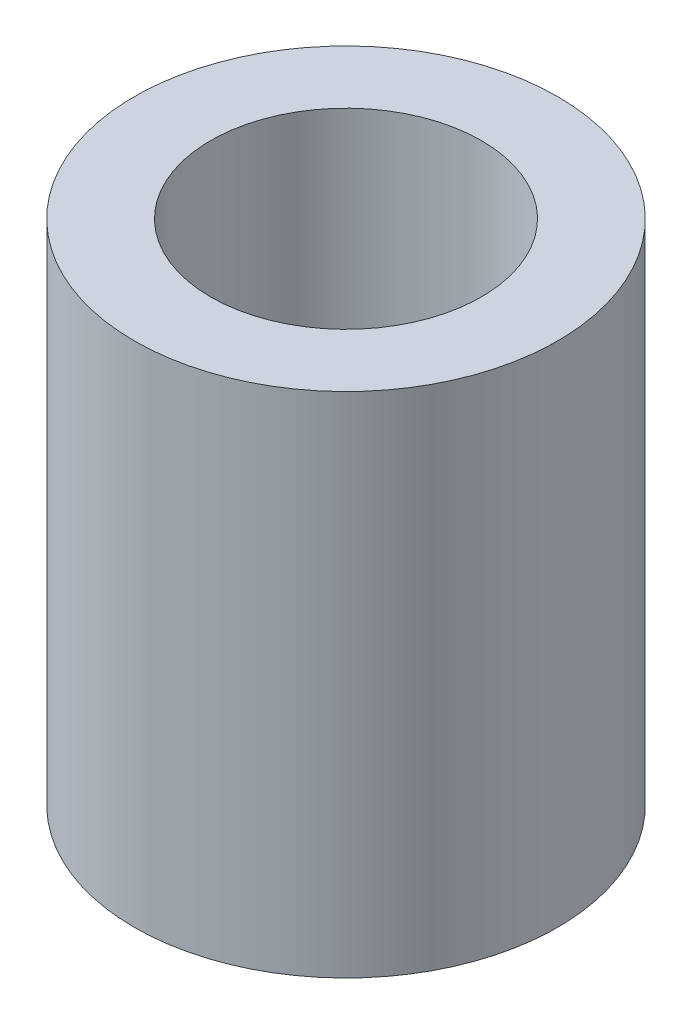
ISO-10303-21;
HEADER;
FILE_DESCRIPTION(('STEP AP214'),'2;1');
FILE_NAME('part.step','',(''),(''),'','','');
FILE_SCHEMA(('AUTOMOTIVE_DESIGN { 1 0 10303 214 1 1 1 1 }'));
ENDSEC;
DATA;
#1=APPLICATION_CONTEXT('core data for automotive mechanical design processes');
#2=APPLICATION_PROTOCOL_DEFINITION('international standard','automotive_design',2000,#1);
#3=PRODUCT_CONTEXT('',#1,'mechanical');
#4=PRODUCT('Part','Part','',(#3));
#5=PRODUCT_RELATED_PRODUCT_CATEGORY('part','',(#4));
#6=PRODUCT_DEFINITION_FORMATION('','',#4);
#7=PRODUCT_DEFINITION_CONTEXT('part definition',#1,'design');
#8=PRODUCT_DEFINITION('design','',#6,#7);
#9=PRODUCT_DEFINITION_SHAPE('','',#8);
#10=(LENGTH_UNIT() NAMED_UNIT(*) SI_UNIT(.MILLI.,.METRE.));
#11=(NAMED_UNIT(*) PLANE_ANGLE_UNIT() SI_UNIT($,.RADIAN.));
#12=(NAMED_UNIT(*) SI_UNIT($,.STERADIAN.) SOLID_ANGLE_UNIT());
#13=UNCERTAINTY_MEASURE_WITH_UNIT(LENGTH_MEASURE(1.E-05),#10,'distance_accuracy_value','');
#14=(GEOMETRIC_REPRESENTATION_CONTEXT(3) GLOBAL_UNCERTAINTY_ASSIGNED_CONTEXT((#13)) GLOBAL_UNIT_ASSIGNED_CONTEXT((#10,
#11,#12)) REPRESENTATION_CONTEXT('',''));
#15=CARTESIAN_POINT('',(0.,0.,0.));
#16=DIRECTION('',(0.,0.,1.));
#17=DIRECTION('',(1.,0.,0.));
#18=AXIS2_PLACEMENT_3D('',#15,#16,#17);
#19=CARTESIAN_POINT('',(0.,6.,0.));
#20=DIRECTION('',(0.,1.,0.));
#21=DIRECTION('',(0.,0.,1.));
#22=AXIS2_PLACEMENT_3D('',#19,#20,#21);
#23=PLANE('',#22);
#24=CARTESIAN_POINT('',(0.,6.,0.));
#25=DIRECTION('',(0.,1.,0.));
#26=DIRECTION('',(0.,0.,1.));
#27=AXIS2_PLACEMENT_3D('',#24,#25,#26);
#28=CIRCLE('',#27,2.5);
#29=CARTESIAN_POINT('',(0.,6.,2.5));
#30=VERTEX_POINT('',#29);
#31=EDGE_CURVE('E10',#30,#30,#28,.T.);
#32=ORIENTED_EDGE('',*,*,#31,.T.);
#33=EDGE_LOOP('',(#32));
#34=FACE_BOUND('',#33,.T.);
#35=CARTESIAN_POINT('',(0.,6.,0.));
#36=DIRECTION('',(0.,1.,0.));
#37=DIRECTION('',(0.,0.,1.));
#38=AXIS2_PLACEMENT_3D('',#35,#36,#37);
#39=CIRCLE('',#38,1.6);
#40=CARTESIAN_POINT('',(0.,6.,1.6));
#41=VERTEX_POINT('',#40);
#42=EDGE_CURVE('E48',#41,#41,#39,.T.);
#43=ORIENTED_EDGE('',*,*,#42,.F.);
#44=EDGE_LOOP('',(#43));
#45=FACE_BOUND('',#44,.T.);
#46=ADVANCED_FACE('F37',(#34,#45),#23,.T.);
#47=CARTESIAN_POINT('',(0.,0.,0.));
#48=DIRECTION('',(0.,1.,0.));
#49=DIRECTION('',(0.,0.,1.));
#50=AXIS2_PLACEMENT_3D('',#47,#48,#49);
#51=PLANE('',#50);
#52=CARTESIAN_POINT('',(0.,0.,0.));
#53=DIRECTION('',(0.,1.,0.));
#54=DIRECTION('',(0.,0.,1.));
#55=AXIS2_PLACEMENT_3D('',#52,#53,#54);
#56=CIRCLE('',#55,2.5);
#57=CARTESIAN_POINT('',(0.,0.,2.5));
#58=VERTEX_POINT('',#57);
#59=EDGE_CURVE('E41',#58,#58,#56,.T.);
#60=ORIENTED_EDGE('',*,*,#59,.F.);
#61=EDGE_LOOP('',(#60));
#62=FACE_BOUND('',#61,.T.);
#63=CARTESIAN_POINT('',(0.,0.,0.));
#64=DIRECTION('',(0.,1.,0.));
#65=DIRECTION('',(0.,0.,1.));
#66=AXIS2_PLACEMENT_3D('',#63,#64,#65);
#67=CIRCLE('',#66,1.6);
#68=CARTESIAN_POINT('',(0.,0.,1.6));
#69=VERTEX_POINT('',#68);
#70=EDGE_CURVE('E50',#69,#69,#67,.T.);
#71=ORIENTED_EDGE('',*,*,#70,.T.);
#72=EDGE_LOOP('',(#71));
#73=FACE_BOUND('',#72,.T.);
#74=ADVANCED_FACE('F60',(#62,#73),#51,.F.);
#75=CARTESIAN_POINT('',(0.,6.,0.));
#76=DIRECTION('',(0.,-1.,0.));
#77=DIRECTION('',(0.,0.,-1.));
#78=AXIS2_PLACEMENT_3D('',#75,#76,#77);
#79=CYLINDRICAL_SURFACE('',#78,2.5);
#80=ORIENTED_EDGE('',*,*,#31,.F.);
#81=EDGE_LOOP('',(#80));
#82=FACE_BOUND('',#81,.T.);
#83=ORIENTED_EDGE('',*,*,#59,.T.);
#84=EDGE_LOOP('',(#83));
#85=FACE_BOUND('',#84,.T.);
#86=ADVANCED_FACE('F39',(#82,#85),#79,.T.);
#87=CARTESIAN_POINT('',(0.,6.,0.));
#88=DIRECTION('',(0.,-1.,0.));
#89=DIRECTION('',(0.,0.,-1.));
#90=AXIS2_PLACEMENT_3D('',#87,#88,#89);
#91=CYLINDRICAL_SURFACE('',#90,1.6);
#92=ORIENTED_EDGE('',*,*,#42,.T.);
#93=EDGE_LOOP('',(#92));
#94=FACE_BOUND('',#93,.T.);
#95=ORIENTED_EDGE('',*,*,#70,.F.);
#96=EDGE_LOOP('',(#95));
#97=FACE_BOUND('',#96,.T.);
#98=ADVANCED_FACE('F56',(#94,#97),#91,.F.);
#99=CLOSED_SHELL('',(#46,#74,#86,#98));
#100=MANIFOLD_SOLID_BREP('B2',#99);
#101=ADVANCED_BREP_SHAPE_REPRESENTATION('',(#18,#100),#14);
#102=SHAPE_DEFINITION_REPRESENTATION(#9,#101);
ENDSEC;
END-ISO-10303-21;
